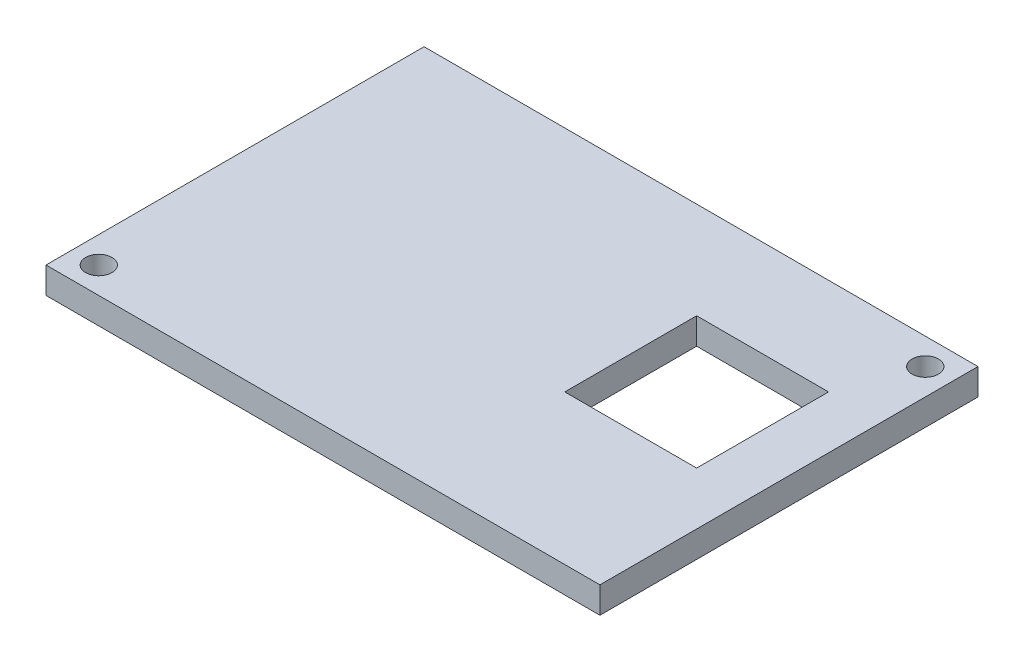
ISO-10303-21;
HEADER;
FILE_DESCRIPTION(('STEP AP214'),'2;1');
FILE_NAME('part.step','',(''),(''),'','','');
FILE_SCHEMA(('AUTOMOTIVE_DESIGN { 1 0 10303 214 1 1 1 1 }'));
ENDSEC;
DATA;
#1=APPLICATION_CONTEXT('core data for automotive mechanical design processes');
#2=APPLICATION_PROTOCOL_DEFINITION('international standard','automotive_design',2000,#1);
#3=PRODUCT_CONTEXT('',#1,'mechanical');
#4=PRODUCT('Part','Part','',(#3));
#5=PRODUCT_RELATED_PRODUCT_CATEGORY('part','',(#4));
#6=PRODUCT_DEFINITION_FORMATION('','',#4);
#7=PRODUCT_DEFINITION_CONTEXT('part definition',#1,'design');
#8=PRODUCT_DEFINITION('design','',#6,#7);
#9=PRODUCT_DEFINITION_SHAPE('','',#8);
#10=(LENGTH_UNIT() NAMED_UNIT(*) SI_UNIT(.MILLI.,.METRE.));
#11=(NAMED_UNIT(*) PLANE_ANGLE_UNIT() SI_UNIT($,.RADIAN.));
#12=(NAMED_UNIT(*) SI_UNIT($,.STERADIAN.) SOLID_ANGLE_UNIT());
#13=UNCERTAINTY_MEASURE_WITH_UNIT(LENGTH_MEASURE(1.E-05),#10,'distance_accuracy_value','');
#14=(GEOMETRIC_REPRESENTATION_CONTEXT(3) GLOBAL_UNCERTAINTY_ASSIGNED_CONTEXT((#13)) GLOBAL_UNIT_ASSIGNED_CONTEXT((#10,
#11,#12)) REPRESENTATION_CONTEXT('',''));
#15=CARTESIAN_POINT('',(0.,0.,0.));
#16=DIRECTION('',(0.,0.,1.));
#17=DIRECTION('',(1.,0.,0.));
#18=AXIS2_PLACEMENT_3D('',#15,#16,#17);
#19=CARTESIAN_POINT('',(-31.8843537414966,3.,-22.6700680272109));
#20=DIRECTION('',(1.,0.,0.));
#21=DIRECTION('',(0.,0.,-1.));
#22=AXIS2_PLACEMENT_3D('',#19,#20,#21);
#23=PLANE('',#22);
#24=DIRECTION('',(0.,0.,1.));
#25=VECTOR('',#24,1.);
#26=CARTESIAN_POINT('',(-31.8843537414966,0.,-22.6700680272109));
#27=LINE('',#26,#25);
#28=CARTESIAN_POINT('',(-31.8843537414966,0.,-22.6700680272109));
#29=VERTEX_POINT('',#28);
#30=CARTESIAN_POINT('',(-31.8843537414966,0.,20.3299319727891));
#31=VERTEX_POINT('',#30);
#32=EDGE_CURVE('E143',#29,#31,#27,.T.);
#33=ORIENTED_EDGE('',*,*,#32,.T.);
#34=DIRECTION('',(0.,-1.,0.));
#35=VECTOR('',#34,1.);
#36=CARTESIAN_POINT('',(-31.8843537414966,3.,20.3299319727891));
#37=LINE('',#36,#35);
#38=CARTESIAN_POINT('',(-31.8843537414966,3.,20.3299319727891));
#39=VERTEX_POINT('',#38);
#40=EDGE_CURVE('E11',#39,#31,#37,.T.);
#41=ORIENTED_EDGE('',*,*,#40,.F.);
#42=DIRECTION('',(0.,0.,1.));
#43=VECTOR('',#42,1.);
#44=CARTESIAN_POINT('',(-31.8843537414966,3.,-22.6700680272109));
#45=LINE('',#44,#43);
#46=CARTESIAN_POINT('',(-31.8843537414966,3.,-22.6700680272109));
#47=VERTEX_POINT('',#46);
#48=EDGE_CURVE('E146',#47,#39,#45,.T.);
#49=ORIENTED_EDGE('',*,*,#48,.F.);
#50=DIRECTION('',(0.,-1.,0.));
#51=VECTOR('',#50,1.);
#52=CARTESIAN_POINT('',(-31.8843537414966,3.,-22.6700680272109));
#53=LINE('',#52,#51);
#54=EDGE_CURVE('E156',#47,#29,#53,.T.);
#55=ORIENTED_EDGE('',*,*,#54,.T.);
#56=EDGE_LOOP('',(#33,#41,#49,#55));
#57=FACE_BOUND('',#56,.T.);
#58=ADVANCED_FACE('F33',(#57),#23,.F.);
#59=CARTESIAN_POINT('',(-31.8843537414966,3.,20.3299319727891));
#60=DIRECTION('',(0.,0.,-1.));
#61=DIRECTION('',(-1.,0.,0.));
#62=AXIS2_PLACEMENT_3D('',#59,#60,#61);
#63=PLANE('',#62);
#64=DIRECTION('',(1.,0.,0.));
#65=VECTOR('',#64,1.);
#66=CARTESIAN_POINT('',(-31.8843537414966,0.,20.3299319727891));
#67=LINE('',#66,#65);
#68=CARTESIAN_POINT('',(31.1156462585034,0.,20.3299319727891));
#69=VERTEX_POINT('',#68);
#70=EDGE_CURVE('E159',#31,#69,#67,.T.);
#71=ORIENTED_EDGE('',*,*,#70,.T.);
#72=DIRECTION('',(0.,-1.,0.));
#73=VECTOR('',#72,1.);
#74=CARTESIAN_POINT('',(31.1156462585034,3.,20.3299319727891));
#75=LINE('',#74,#73);
#76=CARTESIAN_POINT('',(31.1156462585034,3.,20.3299319727891));
#77=VERTEX_POINT('',#76);
#78=EDGE_CURVE('E40',#77,#69,#75,.T.);
#79=ORIENTED_EDGE('',*,*,#78,.F.);
#80=DIRECTION('',(1.,0.,0.));
#81=VECTOR('',#80,1.);
#82=CARTESIAN_POINT('',(-31.8843537414966,3.,20.3299319727891));
#83=LINE('',#82,#81);
#84=EDGE_CURVE('E149',#39,#77,#83,.T.);
#85=ORIENTED_EDGE('',*,*,#84,.F.);
#86=ORIENTED_EDGE('',*,*,#40,.T.);
#87=EDGE_LOOP('',(#71,#79,#85,#86));
#88=FACE_BOUND('',#87,.T.);
#89=ADVANCED_FACE('F188',(#88),#63,.F.);
#90=CARTESIAN_POINT('',(31.1156462585034,3.,-22.6700680272109));
#91=DIRECTION('',(-1.,0.,0.));
#92=DIRECTION('',(0.,0.,1.));
#93=AXIS2_PLACEMENT_3D('',#90,#91,#92);
#94=PLANE('',#93);
#95=DIRECTION('',(0.,0.,-1.));
#96=VECTOR('',#95,1.);
#97=CARTESIAN_POINT('',(31.1156462585034,0.,-22.6700680272109));
#98=LINE('',#97,#96);
#99=CARTESIAN_POINT('',(31.1156462585034,0.,-22.6700680272109));
#100=VERTEX_POINT('',#99);
#101=EDGE_CURVE('E161',#69,#100,#98,.T.);
#102=ORIENTED_EDGE('',*,*,#101,.T.);
#103=DIRECTION('',(0.,-1.,0.));
#104=VECTOR('',#103,1.);
#105=CARTESIAN_POINT('',(31.1156462585034,3.,-22.6700680272109));
#106=LINE('',#105,#104);
#107=CARTESIAN_POINT('',(31.1156462585034,3.,-22.6700680272109));
#108=VERTEX_POINT('',#107);
#109=EDGE_CURVE('E166',#108,#100,#106,.T.);
#110=ORIENTED_EDGE('',*,*,#109,.F.);
#111=DIRECTION('',(0.,0.,-1.));
#112=VECTOR('',#111,1.);
#113=CARTESIAN_POINT('',(31.1156462585034,3.,-22.6700680272109));
#114=LINE('',#113,#112);
#115=EDGE_CURVE('E152',#77,#108,#114,.T.);
#116=ORIENTED_EDGE('',*,*,#115,.F.);
#117=ORIENTED_EDGE('',*,*,#78,.T.);
#118=EDGE_LOOP('',(#102,#110,#116,#117));
#119=FACE_BOUND('',#118,.T.);
#120=ADVANCED_FACE('F173',(#119),#94,.F.);
#121=CARTESIAN_POINT('',(-31.8843537414966,3.,-22.6700680272109));
#122=DIRECTION('',(0.,0.,1.));
#123=DIRECTION('',(1.,0.,0.));
#124=AXIS2_PLACEMENT_3D('',#121,#122,#123);
#125=PLANE('',#124);
#126=DIRECTION('',(-1.,0.,0.));
#127=VECTOR('',#126,1.);
#128=CARTESIAN_POINT('',(-31.8843537414966,0.,-22.6700680272109));
#129=LINE('',#128,#127);
#130=EDGE_CURVE('E150',#100,#29,#129,.T.);
#131=ORIENTED_EDGE('',*,*,#130,.T.);
#132=ORIENTED_EDGE('',*,*,#54,.F.);
#133=DIRECTION('',(-1.,0.,0.));
#134=VECTOR('',#133,1.);
#135=CARTESIAN_POINT('',(-31.8843537414966,3.,-22.6700680272109));
#136=LINE('',#135,#134);
#137=EDGE_CURVE('E154',#108,#47,#136,.T.);
#138=ORIENTED_EDGE('',*,*,#137,.F.);
#139=ORIENTED_EDGE('',*,*,#109,.T.);
#140=EDGE_LOOP('',(#131,#132,#138,#139));
#141=FACE_BOUND('',#140,.T.);
#142=ADVANCED_FACE('F181',(#141),#125,.F.);
#143=CARTESIAN_POINT('',(0.,3.,0.));
#144=DIRECTION('',(0.,1.,0.));
#145=DIRECTION('',(0.,0.,1.));
#146=AXIS2_PLACEMENT_3D('',#143,#144,#145);
#147=PLANE('',#146);
#148=DIRECTION('',(0.,0.,1.));
#149=VECTOR('',#148,1.);
#150=CARTESIAN_POINT('',(10.1156462585034,3.,-11.6700680272109));
#151=LINE('',#150,#149);
#152=CARTESIAN_POINT('',(10.1156462585034,3.,-11.6700680272109));
#153=VERTEX_POINT('',#152);
#154=CARTESIAN_POINT('',(10.1156462585034,3.,3.32993197278911));
#155=VERTEX_POINT('',#154);
#156=EDGE_CURVE('E47',#153,#155,#151,.T.);
#157=ORIENTED_EDGE('',*,*,#156,.F.);
#158=DIRECTION('',(-1.,0.,0.));
#159=VECTOR('',#158,1.);
#160=CARTESIAN_POINT('',(10.1156462585034,3.,-11.6700680272109));
#161=LINE('',#160,#159);
#162=CARTESIAN_POINT('',(25.1156462585034,3.,-11.6700680272109));
#163=VERTEX_POINT('',#162);
#164=EDGE_CURVE('E115',#163,#153,#161,.T.);
#165=ORIENTED_EDGE('',*,*,#164,.F.);
#166=DIRECTION('',(0.,0.,-1.));
#167=VECTOR('',#166,1.);
#168=CARTESIAN_POINT('',(25.1156462585034,3.,-11.6700680272109));
#169=LINE('',#168,#167);
#170=CARTESIAN_POINT('',(25.1156462585034,3.,3.32993197278911));
#171=VERTEX_POINT('',#170);
#172=EDGE_CURVE('E118',#171,#163,#169,.T.);
#173=ORIENTED_EDGE('',*,*,#172,.F.);
#174=DIRECTION('',(1.,0.,0.));
#175=VECTOR('',#174,1.);
#176=CARTESIAN_POINT('',(10.1156462585034,3.,3.32993197278911));
#177=LINE('',#176,#175);
#178=EDGE_CURVE('E124',#155,#171,#177,.T.);
#179=ORIENTED_EDGE('',*,*,#178,.F.);
#180=EDGE_LOOP('',(#157,#165,#173,#179));
#181=FACE_BOUND('',#180,.T.);
#182=CARTESIAN_POINT('',(-28.8843537414966,3.,17.3299319727891));
#183=DIRECTION('',(0.,1.,0.));
#184=DIRECTION('',(0.,0.,1.));
#185=AXIS2_PLACEMENT_3D('',#182,#183,#184);
#186=CIRCLE('',#185,1.5);
#187=CARTESIAN_POINT('',(-28.8843537414966,3.,18.8299319727891));
#188=VERTEX_POINT('',#187);
#189=EDGE_CURVE('E130',#188,#188,#186,.T.);
#190=ORIENTED_EDGE('',*,*,#189,.F.);
#191=EDGE_LOOP('',(#190));
#192=FACE_BOUND('',#191,.T.);
#193=CARTESIAN_POINT('',(28.1156462585034,3.,-19.6700680272109));
#194=DIRECTION('',(0.,1.,0.));
#195=DIRECTION('',(0.,0.,1.));
#196=AXIS2_PLACEMENT_3D('',#193,#194,#195);
#197=CIRCLE('',#196,1.5);
#198=CARTESIAN_POINT('',(28.1156462585034,3.,-18.1700680272109));
#199=VERTEX_POINT('',#198);
#200=EDGE_CURVE('E137',#199,#199,#197,.T.);
#201=ORIENTED_EDGE('',*,*,#200,.F.);
#202=EDGE_LOOP('',(#201));
#203=FACE_BOUND('',#202,.T.);
#204=ORIENTED_EDGE('',*,*,#48,.T.);
#205=ORIENTED_EDGE('',*,*,#84,.T.);
#206=ORIENTED_EDGE('',*,*,#115,.T.);
#207=ORIENTED_EDGE('',*,*,#137,.T.);
#208=EDGE_LOOP('',(#204,#205,#206,#207));
#209=FACE_BOUND('',#208,.T.);
#210=ADVANCED_FACE('F187',(#181,#192,#203,#209),#147,.T.);
#211=CARTESIAN_POINT('',(0.,0.,0.));
#212=DIRECTION('',(0.,1.,0.));
#213=DIRECTION('',(0.,0.,1.));
#214=AXIS2_PLACEMENT_3D('',#211,#212,#213);
#215=PLANE('',#214);
#216=DIRECTION('',(-1.,0.,0.));
#217=VECTOR('',#216,1.);
#218=CARTESIAN_POINT('',(10.1156462585034,0.,-11.6700680272109));
#219=LINE('',#218,#217);
#220=CARTESIAN_POINT('',(25.1156462585034,0.,-11.6700680272109));
#221=VERTEX_POINT('',#220);
#222=CARTESIAN_POINT('',(10.1156462585034,0.,-11.6700680272109));
#223=VERTEX_POINT('',#222);
#224=EDGE_CURVE('E105',#221,#223,#219,.T.);
#225=ORIENTED_EDGE('',*,*,#224,.T.);
#226=DIRECTION('',(0.,0.,1.));
#227=VECTOR('',#226,1.);
#228=CARTESIAN_POINT('',(10.1156462585034,0.,-11.6700680272109));
#229=LINE('',#228,#227);
#230=CARTESIAN_POINT('',(10.1156462585034,0.,3.32993197278911));
#231=VERTEX_POINT('',#230);
#232=EDGE_CURVE('E99',#223,#231,#229,.T.);
#233=ORIENTED_EDGE('',*,*,#232,.T.);
#234=DIRECTION('',(1.,0.,0.));
#235=VECTOR('',#234,1.);
#236=CARTESIAN_POINT('',(10.1156462585034,0.,3.32993197278911));
#237=LINE('',#236,#235);
#238=CARTESIAN_POINT('',(25.1156462585034,0.,3.32993197278911));
#239=VERTEX_POINT('',#238);
#240=EDGE_CURVE('E108',#231,#239,#237,.T.);
#241=ORIENTED_EDGE('',*,*,#240,.T.);
#242=DIRECTION('',(0.,0.,-1.));
#243=VECTOR('',#242,1.);
#244=CARTESIAN_POINT('',(25.1156462585034,0.,-11.6700680272109));
#245=LINE('',#244,#243);
#246=EDGE_CURVE('E55',#239,#221,#245,.T.);
#247=ORIENTED_EDGE('',*,*,#246,.T.);
#248=EDGE_LOOP('',(#225,#233,#241,#247));
#249=FACE_BOUND('',#248,.T.);
#250=CARTESIAN_POINT('',(-28.8843537414966,0.,17.3299319727891));
#251=DIRECTION('',(0.,1.,0.));
#252=DIRECTION('',(0.,0.,1.));
#253=AXIS2_PLACEMENT_3D('',#250,#251,#252);
#254=CIRCLE('',#253,1.5);
#255=CARTESIAN_POINT('',(-28.8843537414966,0.,18.8299319727891));
#256=VERTEX_POINT('',#255);
#257=EDGE_CURVE('E134',#256,#256,#254,.T.);
#258=ORIENTED_EDGE('',*,*,#257,.T.);
#259=EDGE_LOOP('',(#258));
#260=FACE_BOUND('',#259,.T.);
#261=CARTESIAN_POINT('',(28.1156462585034,0.,-19.6700680272109));
#262=DIRECTION('',(0.,1.,0.));
#263=DIRECTION('',(0.,0.,1.));
#264=AXIS2_PLACEMENT_3D('',#261,#262,#263);
#265=CIRCLE('',#264,1.5);
#266=CARTESIAN_POINT('',(28.1156462585034,0.,-18.1700680272109));
#267=VERTEX_POINT('',#266);
#268=EDGE_CURVE('E140',#267,#267,#265,.T.);
#269=ORIENTED_EDGE('',*,*,#268,.T.);
#270=EDGE_LOOP('',(#269));
#271=FACE_BOUND('',#270,.T.);
#272=ORIENTED_EDGE('',*,*,#32,.F.);
#273=ORIENTED_EDGE('',*,*,#130,.F.);
#274=ORIENTED_EDGE('',*,*,#101,.F.);
#275=ORIENTED_EDGE('',*,*,#70,.F.);
#276=EDGE_LOOP('',(#272,#273,#274,#275));
#277=FACE_BOUND('',#276,.T.);
#278=ADVANCED_FACE('F112',(#249,#260,#271,#277),#215,.F.);
#279=CARTESIAN_POINT('',(28.1156462585034,0.,-19.6700680272109));
#280=DIRECTION('',(0.,1.,0.));
#281=DIRECTION('',(0.,0.,1.));
#282=AXIS2_PLACEMENT_3D('',#279,#280,#281);
#283=CYLINDRICAL_SURFACE('',#282,1.5);
#284=ORIENTED_EDGE('',*,*,#268,.F.);
#285=EDGE_LOOP('',(#284));
#286=FACE_BOUND('',#285,.T.);
#287=ORIENTED_EDGE('',*,*,#200,.T.);
#288=EDGE_LOOP('',(#287));
#289=FACE_BOUND('',#288,.T.);
#290=ADVANCED_FACE('F200',(#286,#289),#283,.F.);
#291=CARTESIAN_POINT('',(-28.8843537414966,0.,17.3299319727891));
#292=DIRECTION('',(0.,1.,0.));
#293=DIRECTION('',(0.,0.,1.));
#294=AXIS2_PLACEMENT_3D('',#291,#292,#293);
#295=CYLINDRICAL_SURFACE('',#294,1.5);
#296=ORIENTED_EDGE('',*,*,#257,.F.);
#297=EDGE_LOOP('',(#296));
#298=FACE_BOUND('',#297,.T.);
#299=ORIENTED_EDGE('',*,*,#189,.T.);
#300=EDGE_LOOP('',(#299));
#301=FACE_BOUND('',#300,.T.);
#302=ADVANCED_FACE('F206',(#298,#301),#295,.F.);
#303=CARTESIAN_POINT('',(10.1156462585034,0.,-11.6700680272109));
#304=DIRECTION('',(-1.,0.,0.));
#305=DIRECTION('',(0.,0.,1.));
#306=AXIS2_PLACEMENT_3D('',#303,#304,#305);
#307=PLANE('',#306);
#308=ORIENTED_EDGE('',*,*,#156,.T.);
#309=DIRECTION('',(0.,1.,0.));
#310=VECTOR('',#309,1.);
#311=CARTESIAN_POINT('',(10.1156462585034,0.,3.32993197278911));
#312=LINE('',#311,#310);
#313=EDGE_CURVE('E95',#231,#155,#312,.T.);
#314=ORIENTED_EDGE('',*,*,#313,.F.);
#315=ORIENTED_EDGE('',*,*,#232,.F.);
#316=DIRECTION('',(0.,1.,0.));
#317=VECTOR('',#316,1.);
#318=CARTESIAN_POINT('',(10.1156462585034,0.,-11.6700680272109));
#319=LINE('',#318,#317);
#320=EDGE_CURVE('E128',#223,#153,#319,.T.);
#321=ORIENTED_EDGE('',*,*,#320,.T.);
#322=EDGE_LOOP('',(#308,#314,#315,#321));
#323=FACE_BOUND('',#322,.T.);
#324=ADVANCED_FACE('F97',(#323),#307,.F.);
#325=CARTESIAN_POINT('',(10.1156462585034,0.,-11.6700680272109));
#326=DIRECTION('',(0.,0.,-1.));
#327=DIRECTION('',(-1.,0.,0.));
#328=AXIS2_PLACEMENT_3D('',#325,#326,#327);
#329=PLANE('',#328);
#330=ORIENTED_EDGE('',*,*,#164,.T.);
#331=ORIENTED_EDGE('',*,*,#320,.F.);
#332=ORIENTED_EDGE('',*,*,#224,.F.);
#333=DIRECTION('',(0.,1.,0.));
#334=VECTOR('',#333,1.);
#335=CARTESIAN_POINT('',(25.1156462585034,0.,-11.6700680272109));
#336=LINE('',#335,#334);
#337=EDGE_CURVE('E131',#221,#163,#336,.T.);
#338=ORIENTED_EDGE('',*,*,#337,.T.);
#339=EDGE_LOOP('',(#330,#331,#332,#338));
#340=FACE_BOUND('',#339,.T.);
#341=ADVANCED_FACE('F213',(#340),#329,.F.);
#342=CARTESIAN_POINT('',(25.1156462585034,0.,-11.6700680272109));
#343=DIRECTION('',(1.,0.,0.));
#344=DIRECTION('',(0.,0.,-1.));
#345=AXIS2_PLACEMENT_3D('',#342,#343,#344);
#346=PLANE('',#345);
#347=ORIENTED_EDGE('',*,*,#172,.T.);
#348=ORIENTED_EDGE('',*,*,#337,.F.);
#349=ORIENTED_EDGE('',*,*,#246,.F.);
#350=DIRECTION('',(0.,1.,0.));
#351=VECTOR('',#350,1.);
#352=CARTESIAN_POINT('',(25.1156462585034,0.,3.32993197278911));
#353=LINE('',#352,#351);
#354=EDGE_CURVE('E104',#239,#171,#353,.T.);
#355=ORIENTED_EDGE('',*,*,#354,.T.);
#356=EDGE_LOOP('',(#347,#348,#349,#355));
#357=FACE_BOUND('',#356,.T.);
#358=ADVANCED_FACE('F216',(#357),#346,.F.);
#359=CARTESIAN_POINT('',(10.1156462585034,0.,3.32993197278911));
#360=DIRECTION('',(0.,0.,1.));
#361=DIRECTION('',(1.,0.,0.));
#362=AXIS2_PLACEMENT_3D('',#359,#360,#361);
#363=PLANE('',#362);
#364=ORIENTED_EDGE('',*,*,#178,.T.);
#365=ORIENTED_EDGE('',*,*,#354,.F.);
#366=ORIENTED_EDGE('',*,*,#240,.F.);
#367=ORIENTED_EDGE('',*,*,#313,.T.);
#368=EDGE_LOOP('',(#364,#365,#366,#367));
#369=FACE_BOUND('',#368,.T.);
#370=ADVANCED_FACE('F109',(#369),#363,.F.);
#371=CLOSED_SHELL('',(#58,#89,#120,#142,#210,#278,#290,#302,#324,#341,#358,#370));
#372=MANIFOLD_SOLID_BREP('B2',#371);
#373=ADVANCED_BREP_SHAPE_REPRESENTATION('',(#18,#372),#14);
#374=SHAPE_DEFINITION_REPRESENTATION(#9,#373);
ENDSEC;
END-ISO-10303-21;
